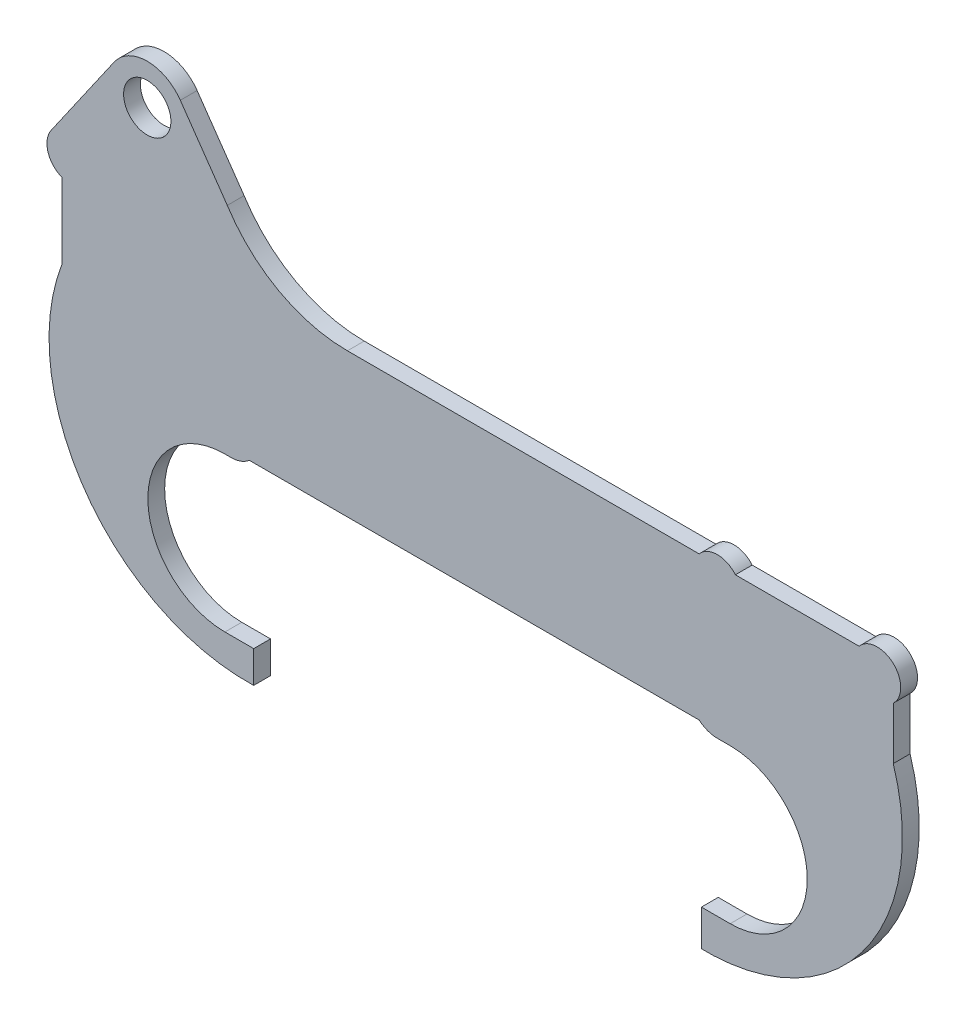
ISO-10303-21;
HEADER;
FILE_DESCRIPTION(('STEP AP214'),'2;1');
FILE_NAME('part.step','',(''),(''),'','','');
FILE_SCHEMA(('AUTOMOTIVE_DESIGN { 1 0 10303 214 1 1 1 1 }'));
ENDSEC;
DATA;
#1=APPLICATION_CONTEXT('core data for automotive mechanical design processes');
#2=APPLICATION_PROTOCOL_DEFINITION('international standard','automotive_design',2000,#1);
#3=PRODUCT_CONTEXT('',#1,'mechanical');
#4=PRODUCT('Part','Part','',(#3));
#5=PRODUCT_RELATED_PRODUCT_CATEGORY('part','',(#4));
#6=PRODUCT_DEFINITION_FORMATION('','',#4);
#7=PRODUCT_DEFINITION_CONTEXT('part definition',#1,'design');
#8=PRODUCT_DEFINITION('design','',#6,#7);
#9=PRODUCT_DEFINITION_SHAPE('','',#8);
#10=(LENGTH_UNIT() NAMED_UNIT(*) SI_UNIT(.MILLI.,.METRE.));
#11=(NAMED_UNIT(*) PLANE_ANGLE_UNIT() SI_UNIT($,.RADIAN.));
#12=(NAMED_UNIT(*) SI_UNIT($,.STERADIAN.) SOLID_ANGLE_UNIT());
#13=UNCERTAINTY_MEASURE_WITH_UNIT(LENGTH_MEASURE(1.E-05),#10,'distance_accuracy_value','');
#14=(GEOMETRIC_REPRESENTATION_CONTEXT(3) GLOBAL_UNCERTAINTY_ASSIGNED_CONTEXT((#13)) GLOBAL_UNIT_ASSIGNED_CONTEXT((#10,
#11,#12)) REPRESENTATION_CONTEXT('',''));
#15=CARTESIAN_POINT('',(0.,0.,0.));
#16=DIRECTION('',(0.,0.,1.));
#17=DIRECTION('',(1.,0.,0.));
#18=AXIS2_PLACEMENT_3D('',#15,#16,#17);
#19=CARTESIAN_POINT('',(0.,0.,6.6802));
#20=DIRECTION('',(0.,1.,0.));
#21=DIRECTION('',(0.,0.,1.));
#22=AXIS2_PLACEMENT_3D('',#19,#20,#21);
#23=PLANE('',#22);
#24=DIRECTION('',(1.,0.,0.));
#25=VECTOR('',#24,1.);
#26=CARTESIAN_POINT('',(0.,0.,0.));
#27=LINE('',#26,#25);
#28=CARTESIAN_POINT('',(74.4752342171825,0.,0.));
#29=VERTEX_POINT('',#28);
#30=CARTESIAN_POINT('',(253.108565782818,0.,0.));
#31=VERTEX_POINT('',#30);
#32=EDGE_CURVE('E240',#29,#31,#27,.T.);
#33=ORIENTED_EDGE('',*,*,#32,.T.);
#34=DIRECTION('',(0.,0.,-1.));
#35=VECTOR('',#34,1.);
#36=CARTESIAN_POINT('',(253.108565782818,0.,6.6802));
#37=LINE('',#36,#35);
#38=CARTESIAN_POINT('',(253.108565782818,0.,6.6802));
#39=VERTEX_POINT('',#38);
#40=EDGE_CURVE('E11',#39,#31,#37,.T.);
#41=ORIENTED_EDGE('',*,*,#40,.F.);
#42=DIRECTION('',(1.,0.,0.));
#43=VECTOR('',#42,1.);
#44=CARTESIAN_POINT('',(0.,0.,6.6802));
#45=LINE('',#44,#43);
#46=CARTESIAN_POINT('',(74.4752342171825,0.,6.6802));
#47=VERTEX_POINT('',#46);
#48=EDGE_CURVE('E373',#47,#39,#45,.T.);
#49=ORIENTED_EDGE('',*,*,#48,.F.);
#50=DIRECTION('',(0.,0.,-1.));
#51=VECTOR('',#50,1.);
#52=CARTESIAN_POINT('',(74.4752342171825,0.,6.6802));
#53=LINE('',#52,#51);
#54=EDGE_CURVE('E236',#47,#29,#53,.T.);
#55=ORIENTED_EDGE('',*,*,#54,.T.);
#56=EDGE_LOOP('',(#33,#41,#49,#55));
#57=FACE_BOUND('',#56,.T.);
#58=ADVANCED_FACE('F36',(#57),#23,.F.);
#59=CARTESIAN_POINT('',(260.3119,8.39428849726891,6.6802));
#60=DIRECTION('',(0.,0.,-1.));
#61=DIRECTION('',(-1.,0.,0.));
#62=AXIS2_PLACEMENT_3D('',#59,#60,#61);
#63=CYLINDRICAL_SURFACE('',#62,11.0612884972689);
#64=CARTESIAN_POINT('',(260.3119,8.39428849726891,0.));
#65=DIRECTION('',(0.,0.,1.));
#66=DIRECTION('',(1.,0.,0.));
#67=AXIS2_PLACEMENT_3D('',#64,#65,#66);
#68=CIRCLE('',#67,11.0612884972689);
#69=CARTESIAN_POINT('',(260.3119,-2.66699999999997,0.));
#70=VERTEX_POINT('',#69);
#71=EDGE_CURVE('E243',#31,#70,#68,.T.);
#72=ORIENTED_EDGE('',*,*,#71,.T.);
#73=DIRECTION('',(0.,0.,-1.));
#74=VECTOR('',#73,1.);
#75=CARTESIAN_POINT('',(260.3119,-2.66699999999997,6.6802));
#76=LINE('',#75,#74);
#77=CARTESIAN_POINT('',(260.3119,-2.66699999999997,6.6802));
#78=VERTEX_POINT('',#77);
#79=EDGE_CURVE('E45',#78,#70,#76,.T.);
#80=ORIENTED_EDGE('',*,*,#79,.F.);
#81=CARTESIAN_POINT('',(260.3119,8.39428849726891,6.6802));
#82=DIRECTION('',(0.,0.,1.));
#83=DIRECTION('',(1.,0.,0.));
#84=AXIS2_PLACEMENT_3D('',#81,#82,#83);
#85=CIRCLE('',#84,11.0612884972689);
#86=EDGE_CURVE('E146',#39,#78,#85,.T.);
#87=ORIENTED_EDGE('',*,*,#86,.F.);
#88=ORIENTED_EDGE('',*,*,#40,.T.);
#89=EDGE_LOOP('',(#72,#80,#87,#88));
#90=FACE_BOUND('',#89,.T.);
#91=ADVANCED_FACE('F356',(#90),#63,.T.);
#92=CARTESIAN_POINT('',(0.,-2.66699999999776,6.6802));
#93=DIRECTION('',(0.,-1.,0.));
#94=DIRECTION('',(1.,0.,0.));
#95=AXIS2_PLACEMENT_3D('',#92,#93,#94);
#96=PLANE('',#95);
#97=DIRECTION('',(-1.,0.,0.));
#98=VECTOR('',#97,1.);
#99=CARTESIAN_POINT('',(0.,-2.66699999999776,0.));
#100=LINE('',#99,#98);
#101=CARTESIAN_POINT('',(265.43,-2.66700000000001,0.));
#102=VERTEX_POINT('',#101);
#103=EDGE_CURVE('E246',#102,#70,#100,.T.);
#104=ORIENTED_EDGE('',*,*,#103,.F.);
#105=DIRECTION('',(0.,0.,-1.));
#106=VECTOR('',#105,1.);
#107=CARTESIAN_POINT('',(265.43,-2.66700000000001,6.6802));
#108=LINE('',#107,#106);
#109=CARTESIAN_POINT('',(265.43,-2.66700000000001,6.6802));
#110=VERTEX_POINT('',#109);
#111=EDGE_CURVE('E349',#110,#102,#108,.T.);
#112=ORIENTED_EDGE('',*,*,#111,.F.);
#113=DIRECTION('',(-1.,0.,0.));
#114=VECTOR('',#113,1.);
#115=CARTESIAN_POINT('',(0.,-2.66699999999776,6.6802));
#116=LINE('',#115,#114);
#117=EDGE_CURVE('E355',#110,#78,#116,.T.);
#118=ORIENTED_EDGE('',*,*,#117,.T.);
#119=ORIENTED_EDGE('',*,*,#79,.T.);
#120=EDGE_LOOP('',(#104,#112,#118,#119));
#121=FACE_BOUND('',#120,.T.);
#122=ADVANCED_FACE('F353',(#121),#96,.T.);
#123=CARTESIAN_POINT('',(265.43,-33.274,6.6802));
#124=DIRECTION('',(0.,0.,-1.));
#125=DIRECTION('',(-1.,0.,0.));
#126=AXIS2_PLACEMENT_3D('',#123,#124,#125);
#127=CYLINDRICAL_SURFACE('',#126,30.607);
#128=CARTESIAN_POINT('',(265.43,-33.274,0.));
#129=DIRECTION('',(0.,0.,1.));
#130=DIRECTION('',(1.,0.,0.));
#131=AXIS2_PLACEMENT_3D('',#128,#129,#130);
#132=CIRCLE('',#131,30.607);
#133=CARTESIAN_POINT('',(265.43,-63.881,0.));
#134=VERTEX_POINT('',#133);
#135=EDGE_CURVE('E249',#134,#102,#132,.T.);
#136=ORIENTED_EDGE('',*,*,#135,.F.);
#137=DIRECTION('',(0.,0.,-1.));
#138=VECTOR('',#137,1.);
#139=CARTESIAN_POINT('',(265.43,-63.881,6.6802));
#140=LINE('',#139,#138);
#141=CARTESIAN_POINT('',(265.43,-63.881,6.6802));
#142=VERTEX_POINT('',#141);
#143=EDGE_CURVE('E347',#142,#134,#140,.T.);
#144=ORIENTED_EDGE('',*,*,#143,.F.);
#145=CARTESIAN_POINT('',(265.43,-33.274,6.6802));
#146=DIRECTION('',(0.,0.,1.));
#147=DIRECTION('',(1.,0.,0.));
#148=AXIS2_PLACEMENT_3D('',#145,#146,#147);
#149=CIRCLE('',#148,30.607);
#150=EDGE_CURVE('E369',#142,#110,#149,.T.);
#151=ORIENTED_EDGE('',*,*,#150,.T.);
#152=ORIENTED_EDGE('',*,*,#111,.T.);
#153=EDGE_LOOP('',(#136,#144,#151,#152));
#154=FACE_BOUND('',#153,.T.);
#155=ADVANCED_FACE('F365',(#154),#127,.F.);
#156=CARTESIAN_POINT('',(0.,-63.8809999999997,6.6802));
#157=DIRECTION('',(0.,-1.,0.));
#158=DIRECTION('',(1.,0.,0.));
#159=AXIS2_PLACEMENT_3D('',#156,#157,#158);
#160=PLANE('',#159);
#161=DIRECTION('',(-1.,0.,0.));
#162=VECTOR('',#161,1.);
#163=CARTESIAN_POINT('',(0.,-63.8809999999997,0.));
#164=LINE('',#163,#162);
#165=CARTESIAN_POINT('',(254.,-63.881,0.));
#166=VERTEX_POINT('',#165);
#167=EDGE_CURVE('E252',#134,#166,#164,.T.);
#168=ORIENTED_EDGE('',*,*,#167,.T.);
#169=DIRECTION('',(0.,0.,-1.));
#170=VECTOR('',#169,1.);
#171=CARTESIAN_POINT('',(254.,-63.881,6.6802));
#172=LINE('',#171,#170);
#173=CARTESIAN_POINT('',(254.,-63.881,6.6802));
#174=VERTEX_POINT('',#173);
#175=EDGE_CURVE('E344',#174,#166,#172,.T.);
#176=ORIENTED_EDGE('',*,*,#175,.F.);
#177=DIRECTION('',(-1.,0.,0.));
#178=VECTOR('',#177,1.);
#179=CARTESIAN_POINT('',(0.,-63.8809999999997,6.6802));
#180=LINE('',#179,#178);
#181=EDGE_CURVE('E371',#142,#174,#180,.T.);
#182=ORIENTED_EDGE('',*,*,#181,.F.);
#183=ORIENTED_EDGE('',*,*,#143,.T.);
#184=EDGE_LOOP('',(#168,#176,#182,#183));
#185=FACE_BOUND('',#184,.T.);
#186=ADVANCED_FACE('F447',(#185),#160,.F.);
#187=CARTESIAN_POINT('',(254.,0.,6.6802));
#188=DIRECTION('',(1.,0.,0.));
#189=DIRECTION('',(0.,0.,-1.));
#190=AXIS2_PLACEMENT_3D('',#187,#188,#189);
#191=PLANE('',#190);
#192=DIRECTION('',(0.,-1.,0.));
#193=VECTOR('',#192,1.);
#194=CARTESIAN_POINT('',(254.,0.,0.));
#195=LINE('',#194,#193);
#196=CARTESIAN_POINT('',(254.,-78.1924621020167,0.));
#197=VERTEX_POINT('',#196);
#198=EDGE_CURVE('E254',#166,#197,#195,.T.);
#199=ORIENTED_EDGE('',*,*,#198,.T.);
#200=DIRECTION('',(0.,0.,-1.));
#201=VECTOR('',#200,1.);
#202=CARTESIAN_POINT('',(254.,-78.1924621020167,6.6802));
#203=LINE('',#202,#201);
#204=CARTESIAN_POINT('',(254.,-78.1924621020167,6.6802));
#205=VERTEX_POINT('',#204);
#206=EDGE_CURVE('E342',#205,#197,#203,.T.);
#207=ORIENTED_EDGE('',*,*,#206,.F.);
#208=DIRECTION('',(0.,-1.,0.));
#209=VECTOR('',#208,1.);
#210=CARTESIAN_POINT('',(254.,0.,6.6802));
#211=LINE('',#210,#209);
#212=EDGE_CURVE('E378',#174,#205,#211,.T.);
#213=ORIENTED_EDGE('',*,*,#212,.F.);
#214=ORIENTED_EDGE('',*,*,#175,.T.);
#215=EDGE_LOOP('',(#199,#207,#213,#214));
#216=FACE_BOUND('',#215,.T.);
#217=ADVANCED_FACE('F450',(#216),#191,.F.);
#218=CARTESIAN_POINT('',(4.51694506166777E-13,-78.1924621020182,6.6802));
#219=DIRECTION('',(0.,-1.,0.));
#220=DIRECTION('',(1.,0.,0.));
#221=AXIS2_PLACEMENT_3D('',#218,#219,#220);
#222=PLANE('',#221);
#223=DIRECTION('',(-1.,0.,0.));
#224=VECTOR('',#223,1.);
#225=CARTESIAN_POINT('',(4.51694506166777E-13,-78.1924621020182,0.));
#226=LINE('',#225,#224);
#227=CARTESIAN_POINT('',(258.804744721964,-78.1924621020167,0.));
#228=VERTEX_POINT('',#227);
#229=EDGE_CURVE('E257',#228,#197,#226,.T.);
#230=ORIENTED_EDGE('',*,*,#229,.F.);
#231=DIRECTION('',(0.,0.,-1.));
#232=VECTOR('',#231,1.);
#233=CARTESIAN_POINT('',(258.804744721964,-78.1924621020167,6.6802));
#234=LINE('',#233,#232);
#235=CARTESIAN_POINT('',(258.804744721964,-78.1924621020167,6.6802));
#236=VERTEX_POINT('',#235);
#237=EDGE_CURVE('E340',#236,#228,#234,.T.);
#238=ORIENTED_EDGE('',*,*,#237,.F.);
#239=DIRECTION('',(-1.,0.,0.));
#240=VECTOR('',#239,1.);
#241=CARTESIAN_POINT('',(4.51694506166777E-13,-78.1924621020182,6.6802));
#242=LINE('',#241,#240);
#243=EDGE_CURVE('E380',#236,#205,#242,.T.);
#244=ORIENTED_EDGE('',*,*,#243,.T.);
#245=ORIENTED_EDGE('',*,*,#206,.T.);
#246=EDGE_LOOP('',(#230,#238,#244,#245));
#247=FACE_BOUND('',#246,.T.);
#248=ADVANCED_FACE('F454',(#247),#222,.T.);
#249=CARTESIAN_POINT('',(255.575891342925,0.,6.6802));
#250=DIRECTION('',(0.,0.,-1.));
#251=DIRECTION('',(-1.,0.,0.));
#252=AXIS2_PLACEMENT_3D('',#249,#250,#251);
#253=CYLINDRICAL_SURFACE('',#252,78.2590993030117);
#254=CARTESIAN_POINT('',(255.575891342925,0.,0.));
#255=DIRECTION('',(0.,0.,1.));
#256=DIRECTION('',(1.,0.,0.));
#257=AXIS2_PLACEMENT_3D('',#254,#255,#256);
#258=CIRCLE('',#257,78.2590993030117);
#259=CARTESIAN_POINT('',(330.2,23.5739057191571,0.));
#260=VERTEX_POINT('',#259);
#261=EDGE_CURVE('E260',#228,#260,#258,.T.);
#262=ORIENTED_EDGE('',*,*,#261,.T.);
#263=DIRECTION('',(0.,0.,-1.));
#264=VECTOR('',#263,1.);
#265=CARTESIAN_POINT('',(330.2,23.5739057191571,6.6802));
#266=LINE('',#265,#264);
#267=CARTESIAN_POINT('',(330.2,23.5739057191571,6.6802));
#268=VERTEX_POINT('',#267);
#269=EDGE_CURVE('E337',#268,#260,#266,.T.);
#270=ORIENTED_EDGE('',*,*,#269,.F.);
#271=CARTESIAN_POINT('',(255.575891342925,0.,6.6802));
#272=DIRECTION('',(0.,0.,1.));
#273=DIRECTION('',(1.,0.,0.));
#274=AXIS2_PLACEMENT_3D('',#271,#272,#273);
#275=CIRCLE('',#274,78.2590993030117);
#276=EDGE_CURVE('E383',#236,#268,#275,.T.);
#277=ORIENTED_EDGE('',*,*,#276,.F.);
#278=ORIENTED_EDGE('',*,*,#237,.T.);
#279=EDGE_LOOP('',(#262,#270,#277,#278));
#280=FACE_BOUND('',#279,.T.);
#281=ADVANCED_FACE('F458',(#280),#253,.T.);
#282=CARTESIAN_POINT('',(330.2,1.7649972717152E-12,6.6802));
#283=DIRECTION('',(-1.,0.,0.));
#284=DIRECTION('',(0.,-1.,0.));
#285=AXIS2_PLACEMENT_3D('',#282,#283,#284);
#286=PLANE('',#285);
#287=DIRECTION('',(0.,1.,0.));
#288=VECTOR('',#287,1.);
#289=CARTESIAN_POINT('',(330.2,1.7649972717152E-12,0.));
#290=LINE('',#289,#288);
#291=CARTESIAN_POINT('',(330.2,44.3442291981829,0.));
#292=VERTEX_POINT('',#291);
#293=EDGE_CURVE('E262',#260,#292,#290,.T.);
#294=ORIENTED_EDGE('',*,*,#293,.T.);
#295=DIRECTION('',(0.,0.,-1.));
#296=VECTOR('',#295,1.);
#297=CARTESIAN_POINT('',(330.2,44.3442291981829,6.6802));
#298=LINE('',#297,#296);
#299=CARTESIAN_POINT('',(330.2,44.3442291981829,6.6802));
#300=VERTEX_POINT('',#299);
#301=EDGE_CURVE('E334',#300,#292,#298,.T.);
#302=ORIENTED_EDGE('',*,*,#301,.F.);
#303=DIRECTION('',(0.,1.,0.));
#304=VECTOR('',#303,1.);
#305=CARTESIAN_POINT('',(330.2,1.7649972717152E-12,6.6802));
#306=LINE('',#305,#304);
#307=EDGE_CURVE('E385',#268,#300,#306,.T.);
#308=ORIENTED_EDGE('',*,*,#307,.F.);
#309=ORIENTED_EDGE('',*,*,#269,.T.);
#310=EDGE_LOOP('',(#294,#302,#308,#309));
#311=FACE_BOUND('',#310,.T.);
#312=ADVANCED_FACE('F462',(#311),#286,.F.);
#313=CARTESIAN_POINT('',(323.8119,51.1678884972689,6.6802));
#314=DIRECTION('',(0.,0.,-1.));
#315=DIRECTION('',(-1.,0.,0.));
#316=AXIS2_PLACEMENT_3D('',#313,#314,#315);
#317=CYLINDRICAL_SURFACE('',#316,9.3472);
#318=CARTESIAN_POINT('',(323.8119,51.1678884972689,0.));
#319=DIRECTION('',(0.,0.,1.));
#320=DIRECTION('',(1.,0.,0.));
#321=AXIS2_PLACEMENT_3D('',#318,#319,#320);
#322=CIRCLE('',#321,9.3472);
#323=CARTESIAN_POINT('',(316.629665681288,57.15,0.));
#324=VERTEX_POINT('',#323);
#325=EDGE_CURVE('E264',#292,#324,#322,.T.);
#326=ORIENTED_EDGE('',*,*,#325,.T.);
#327=DIRECTION('',(0.,0.,-1.));
#328=VECTOR('',#327,1.);
#329=CARTESIAN_POINT('',(316.629665681288,57.15,6.6802));
#330=LINE('',#329,#328);
#331=CARTESIAN_POINT('',(316.629665681288,57.15,6.6802));
#332=VERTEX_POINT('',#331);
#333=EDGE_CURVE('E332',#332,#324,#330,.T.);
#334=ORIENTED_EDGE('',*,*,#333,.F.);
#335=CARTESIAN_POINT('',(323.8119,51.1678884972689,6.6802));
#336=DIRECTION('',(0.,0.,1.));
#337=DIRECTION('',(1.,0.,0.));
#338=AXIS2_PLACEMENT_3D('',#335,#336,#337);
#339=CIRCLE('',#338,9.3472);
#340=EDGE_CURVE('E387',#300,#332,#339,.T.);
#341=ORIENTED_EDGE('',*,*,#340,.F.);
#342=ORIENTED_EDGE('',*,*,#301,.T.);
#343=EDGE_LOOP('',(#326,#334,#341,#342));
#344=FACE_BOUND('',#343,.T.);
#345=ADVANCED_FACE('F466',(#344),#317,.T.);
#346=CARTESIAN_POINT('',(0.,57.15,6.6802));
#347=DIRECTION('',(0.,1.,0.));
#348=DIRECTION('',(0.,0.,1.));
#349=AXIS2_PLACEMENT_3D('',#346,#347,#348);
#350=PLANE('',#349);
#351=DIRECTION('',(1.,0.,0.));
#352=VECTOR('',#351,1.);
#353=CARTESIAN_POINT('',(0.,57.15,0.));
#354=LINE('',#353,#352);
#355=CARTESIAN_POINT('',(267.494134318713,57.15,0.));
#356=VERTEX_POINT('',#355);
#357=EDGE_CURVE('E267',#356,#324,#354,.T.);
#358=ORIENTED_EDGE('',*,*,#357,.F.);
#359=DIRECTION('',(0.,0.,-1.));
#360=VECTOR('',#359,1.);
#361=CARTESIAN_POINT('',(267.494134318713,57.15,6.6802));
#362=LINE('',#361,#360);
#363=CARTESIAN_POINT('',(267.494134318713,57.15,6.6802));
#364=VERTEX_POINT('',#363);
#365=EDGE_CURVE('E330',#364,#356,#362,.T.);
#366=ORIENTED_EDGE('',*,*,#365,.F.);
#367=DIRECTION('',(1.,0.,0.));
#368=VECTOR('',#367,1.);
#369=CARTESIAN_POINT('',(0.,57.15,6.6802));
#370=LINE('',#369,#368);
#371=EDGE_CURVE('E389',#364,#332,#370,.T.);
#372=ORIENTED_EDGE('',*,*,#371,.T.);
#373=ORIENTED_EDGE('',*,*,#333,.T.);
#374=EDGE_LOOP('',(#358,#366,#372,#373));
#375=FACE_BOUND('',#374,.T.);
#376=ADVANCED_FACE('F470',(#375),#350,.T.);
#377=CARTESIAN_POINT('',(260.3119,51.1678884972689,6.6802));
#378=DIRECTION('',(0.,0.,-1.));
#379=DIRECTION('',(-1.,0.,0.));
#380=AXIS2_PLACEMENT_3D('',#377,#378,#379);
#381=CYLINDRICAL_SURFACE('',#380,9.34720000000001);
#382=CARTESIAN_POINT('',(260.3119,51.1678884972689,0.));
#383=DIRECTION('',(0.,0.,1.));
#384=DIRECTION('',(1.,0.,0.));
#385=AXIS2_PLACEMENT_3D('',#382,#383,#384);
#386=CIRCLE('',#385,9.34720000000001);
#387=CARTESIAN_POINT('',(253.129665681288,57.15,0.));
#388=VERTEX_POINT('',#387);
#389=EDGE_CURVE('E270',#356,#388,#386,.T.);
#390=ORIENTED_EDGE('',*,*,#389,.T.);
#391=DIRECTION('',(0.,0.,-1.));
#392=VECTOR('',#391,1.);
#393=CARTESIAN_POINT('',(253.129665681288,57.15,6.6802));
#394=LINE('',#393,#392);
#395=CARTESIAN_POINT('',(253.129665681288,57.15,6.6802));
#396=VERTEX_POINT('',#395);
#397=EDGE_CURVE('E328',#396,#388,#394,.T.);
#398=ORIENTED_EDGE('',*,*,#397,.F.);
#399=CARTESIAN_POINT('',(260.3119,51.1678884972689,6.6802));
#400=DIRECTION('',(0.,0.,1.));
#401=DIRECTION('',(1.,0.,0.));
#402=AXIS2_PLACEMENT_3D('',#399,#400,#401);
#403=CIRCLE('',#402,9.34720000000001);
#404=EDGE_CURVE('E392',#364,#396,#403,.T.);
#405=ORIENTED_EDGE('',*,*,#404,.F.);
#406=ORIENTED_EDGE('',*,*,#365,.T.);
#407=EDGE_LOOP('',(#390,#398,#405,#406));
#408=FACE_BOUND('',#407,.T.);
#409=ADVANCED_FACE('F474',(#408),#381,.T.);
#410=CARTESIAN_POINT('',(0.,57.15,6.6802));
#411=DIRECTION('',(0.,1.,0.));
#412=DIRECTION('',(0.,0.,1.));
#413=AXIS2_PLACEMENT_3D('',#410,#411,#412);
#414=PLANE('',#413);
#415=DIRECTION('',(1.,0.,0.));
#416=VECTOR('',#415,1.);
#417=CARTESIAN_POINT('',(0.,57.15,0.));
#418=LINE('',#417,#416);
#419=CARTESIAN_POINT('',(113.415260688281,57.15,0.));
#420=VERTEX_POINT('',#419);
#421=EDGE_CURVE('E273',#420,#388,#418,.T.);
#422=ORIENTED_EDGE('',*,*,#421,.F.);
#423=DIRECTION('',(0.,0.,-1.));
#424=VECTOR('',#423,1.);
#425=CARTESIAN_POINT('',(113.415260688281,57.15,6.6802));
#426=LINE('',#425,#424);
#427=CARTESIAN_POINT('',(113.415260688281,57.15,6.6802));
#428=VERTEX_POINT('',#427);
#429=EDGE_CURVE('E326',#428,#420,#426,.T.);
#430=ORIENTED_EDGE('',*,*,#429,.F.);
#431=DIRECTION('',(1.,0.,0.));
#432=VECTOR('',#431,1.);
#433=CARTESIAN_POINT('',(0.,57.15,6.6802));
#434=LINE('',#433,#432);
#435=EDGE_CURVE('E394',#428,#396,#434,.T.);
#436=ORIENTED_EDGE('',*,*,#435,.T.);
#437=ORIENTED_EDGE('',*,*,#397,.T.);
#438=EDGE_LOOP('',(#422,#430,#436,#437));
#439=FACE_BOUND('',#438,.T.);
#440=ADVANCED_FACE('F478',(#439),#414,.T.);
#441=CARTESIAN_POINT('',(113.415260688281,113.711052983826,6.6802));
#442=DIRECTION('',(0.,0.,-1.));
#443=DIRECTION('',(-1.,0.,0.));
#444=AXIS2_PLACEMENT_3D('',#441,#442,#443);
#445=CYLINDRICAL_SURFACE('',#444,56.561052983826);
#446=CARTESIAN_POINT('',(113.415260688281,113.711052983826,0.));
#447=DIRECTION('',(0.,0.,1.));
#448=DIRECTION('',(1.,0.,0.));
#449=AXIS2_PLACEMENT_3D('',#446,#447,#448);
#450=CIRCLE('',#449,56.561052983826);
#451=CARTESIAN_POINT('',(65.7097247748721,83.3246323678077,0.));
#452=VERTEX_POINT('',#451);
#453=EDGE_CURVE('E276',#452,#420,#450,.T.);
#454=ORIENTED_EDGE('',*,*,#453,.F.);
#455=DIRECTION('',(0.,0.,-1.));
#456=VECTOR('',#455,1.);
#457=CARTESIAN_POINT('',(65.7097247748721,83.3246323678077,6.6802));
#458=LINE('',#457,#456);
#459=CARTESIAN_POINT('',(65.7097247748721,83.3246323678077,6.6802));
#460=VERTEX_POINT('',#459);
#461=EDGE_CURVE('E324',#460,#452,#458,.T.);
#462=ORIENTED_EDGE('',*,*,#461,.F.);
#463=CARTESIAN_POINT('',(113.415260688281,113.711052983826,6.6802));
#464=DIRECTION('',(0.,0.,1.));
#465=DIRECTION('',(1.,0.,0.));
#466=AXIS2_PLACEMENT_3D('',#463,#464,#465);
#467=CIRCLE('',#466,56.561052983826);
#468=EDGE_CURVE('E397',#460,#428,#467,.T.);
#469=ORIENTED_EDGE('',*,*,#468,.T.);
#470=ORIENTED_EDGE('',*,*,#429,.T.);
#471=EDGE_LOOP('',(#454,#462,#469,#470));
#472=FACE_BOUND('',#471,.T.);
#473=ADVANCED_FACE('F482',(#472),#445,.F.);
#474=CARTESIAN_POINT('',(83.3451153624948,57.9695209357769,6.6802));
#475=DIRECTION('',(-0.82094994249364,-0.571000168055744,0.));
#476=DIRECTION('',(0.571000168055744,-0.820949942493641,0.));
#477=AXIS2_PLACEMENT_3D('',#474,#475,#476);
#478=PLANE('',#477);
#479=DIRECTION('',(-0.571000168055744,0.820949942493641,0.));
#480=VECTOR('',#479,1.);
#481=CARTESIAN_POINT('',(83.3451153624948,57.9695209357769,0.));
#482=LINE('',#481,#480);
#483=CARTESIAN_POINT('',(47.0585033672193,110.140244689228,0.));
#484=VERTEX_POINT('',#483);
#485=EDGE_CURVE('E279',#452,#484,#482,.T.);
#486=ORIENTED_EDGE('',*,*,#485,.T.);
#487=DIRECTION('',(0.,0.,-1.));
#488=VECTOR('',#487,1.);
#489=CARTESIAN_POINT('',(47.0585033672193,110.140244689228,6.6802));
#490=LINE('',#489,#488);
#491=CARTESIAN_POINT('',(47.0585033672193,110.140244689228,6.6802));
#492=VERTEX_POINT('',#491);
#493=EDGE_CURVE('E321',#492,#484,#490,.T.);
#494=ORIENTED_EDGE('',*,*,#493,.F.);
#495=DIRECTION('',(-0.571000168055744,0.820949942493641,0.));
#496=VECTOR('',#495,1.);
#497=CARTESIAN_POINT('',(83.3451153624948,57.9695209357769,6.6802));
#498=LINE('',#497,#496);
#499=EDGE_CURVE('E400',#460,#492,#498,.T.);
#500=ORIENTED_EDGE('',*,*,#499,.F.);
#501=ORIENTED_EDGE('',*,*,#461,.T.);
#502=EDGE_LOOP('',(#486,#494,#500,#501));
#503=FACE_BOUND('',#502,.T.);
#504=ADVANCED_FACE('F486',(#503),#478,.F.);
#505=CARTESIAN_POINT('',(33.9216623874361,101.0031,6.6802));
#506=DIRECTION('',(0.,0.,-1.));
#507=DIRECTION('',(-1.,0.,0.));
#508=AXIS2_PLACEMENT_3D('',#505,#506,#507);
#509=CYLINDRICAL_SURFACE('',#508,16.002);
#510=CARTESIAN_POINT('',(33.9216623874361,101.0031,0.));
#511=DIRECTION('',(0.,0.,1.));
#512=DIRECTION('',(1.,0.,0.));
#513=AXIS2_PLACEMENT_3D('',#510,#511,#512);
#514=CIRCLE('',#513,16.002);
#515=CARTESIAN_POINT('',(20.7848214076528,110.140244689228,0.));
#516=VERTEX_POINT('',#515);
#517=EDGE_CURVE('E281',#484,#516,#514,.T.);
#518=ORIENTED_EDGE('',*,*,#517,.T.);
#519=DIRECTION('',(0.,0.,-1.));
#520=VECTOR('',#519,1.);
#521=CARTESIAN_POINT('',(20.7848214076528,110.140244689228,6.6802));
#522=LINE('',#521,#520);
#523=CARTESIAN_POINT('',(20.7848214076528,110.140244689228,6.6802));
#524=VERTEX_POINT('',#523);
#525=EDGE_CURVE('E319',#524,#516,#522,.T.);
#526=ORIENTED_EDGE('',*,*,#525,.F.);
#527=CARTESIAN_POINT('',(33.9216623874361,101.0031,6.6802));
#528=DIRECTION('',(0.,0.,1.));
#529=DIRECTION('',(1.,0.,0.));
#530=AXIS2_PLACEMENT_3D('',#527,#528,#529);
#531=CIRCLE('',#530,16.002);
#532=EDGE_CURVE('E402',#492,#524,#531,.T.);
#533=ORIENTED_EDGE('',*,*,#532,.F.);
#534=ORIENTED_EDGE('',*,*,#493,.T.);
#535=EDGE_LOOP('',(#518,#526,#533,#534));
#536=FACE_BOUND('',#535,.T.);
#537=ADVANCED_FACE('F490',(#536),#509,.T.);
#538=CARTESIAN_POINT('',(-37.6215090610164,26.1671106658461,6.6802));
#539=DIRECTION('',(-0.820949942493641,0.571000168055744,0.));
#540=DIRECTION('',(-0.571000168055744,-0.820949942493641,0.));
#541=AXIS2_PLACEMENT_3D('',#538,#539,#540);
#542=PLANE('',#541);
#543=DIRECTION('',(0.571000168055744,0.820949942493641,0.));
#544=VECTOR('',#543,1.);
#545=CARTESIAN_POINT('',(-37.6215090610164,26.1671106658461,0.));
#546=LINE('',#545,#544);
#547=CARTESIAN_POINT('',(-4.2359920945924,74.166813235164,0.));
#548=VERTEX_POINT('',#547);
#549=EDGE_CURVE('E284',#548,#516,#546,.T.);
#550=ORIENTED_EDGE('',*,*,#549,.F.);
#551=DIRECTION('',(0.,0.,-1.));
#552=VECTOR('',#551,1.);
#553=CARTESIAN_POINT('',(-4.2359920945924,74.166813235164,6.6802));
#554=LINE('',#553,#552);
#555=CARTESIAN_POINT('',(-4.2359920945924,74.166813235164,6.6802));
#556=VERTEX_POINT('',#555);
#557=EDGE_CURVE('E317',#556,#548,#554,.T.);
#558=ORIENTED_EDGE('',*,*,#557,.F.);
#559=DIRECTION('',(0.571000168055744,0.820949942493641,0.));
#560=VECTOR('',#559,1.);
#561=CARTESIAN_POINT('',(-37.6215090610164,26.1671106658461,6.6802));
#562=LINE('',#561,#560);
#563=EDGE_CURVE('E404',#556,#524,#562,.T.);
#564=ORIENTED_EDGE('',*,*,#563,.T.);
#565=ORIENTED_EDGE('',*,*,#525,.T.);
#566=EDGE_LOOP('',(#550,#558,#564,#565));
#567=FACE_BOUND('',#566,.T.);
#568=ADVANCED_FACE('F494',(#567),#542,.T.);
#569=CARTESIAN_POINT('',(3.43759120788416,68.8295604643134,6.6802));
#570=DIRECTION('',(0.,0.,-1.));
#571=DIRECTION('',(-1.,0.,0.));
#572=AXIS2_PLACEMENT_3D('',#569,#570,#571);
#573=CYLINDRICAL_SURFACE('',#572,9.3472);
#574=CARTESIAN_POINT('',(3.43759120788416,68.8295604643134,0.));
#575=DIRECTION('',(0.,0.,1.));
#576=DIRECTION('',(1.,0.,0.));
#577=AXIS2_PLACEMENT_3D('',#574,#575,#576);
#578=CIRCLE('',#577,9.3472);
#579=CARTESIAN_POINT('',(-2.22044604925031E-13,60.1374310055745,0.));
#580=VERTEX_POINT('',#579);
#581=EDGE_CURVE('E287',#548,#580,#578,.T.);
#582=ORIENTED_EDGE('',*,*,#581,.T.);
#583=DIRECTION('',(0.,0.,-1.));
#584=VECTOR('',#583,1.);
#585=CARTESIAN_POINT('',(-2.22044604925031E-13,60.1374310055745,6.6802));
#586=LINE('',#585,#584);
#587=CARTESIAN_POINT('',(-2.22044604925031E-13,60.1374310055745,6.6802));
#588=VERTEX_POINT('',#587);
#589=EDGE_CURVE('E315',#588,#580,#586,.T.);
#590=ORIENTED_EDGE('',*,*,#589,.F.);
#591=CARTESIAN_POINT('',(3.43759120788416,68.8295604643134,6.6802));
#592=DIRECTION('',(0.,0.,1.));
#593=DIRECTION('',(1.,0.,0.));
#594=AXIS2_PLACEMENT_3D('',#591,#592,#593);
#595=CIRCLE('',#594,9.3472);
#596=EDGE_CURVE('E407',#556,#588,#595,.T.);
#597=ORIENTED_EDGE('',*,*,#596,.F.);
#598=ORIENTED_EDGE('',*,*,#557,.T.);
#599=EDGE_LOOP('',(#582,#590,#597,#598));
#600=FACE_BOUND('',#599,.T.);
#601=ADVANCED_FACE('F498',(#600),#573,.T.);
#602=CARTESIAN_POINT('',(0.,0.,6.6802));
#603=DIRECTION('',(-1.,0.,0.));
#604=DIRECTION('',(0.,-1.,0.));
#605=AXIS2_PLACEMENT_3D('',#602,#603,#604);
#606=PLANE('',#605);
#607=DIRECTION('',(0.,1.,0.));
#608=VECTOR('',#607,1.);
#609=CARTESIAN_POINT('',(0.,0.,0.));
#610=LINE('',#609,#608);
#611=CARTESIAN_POINT('',(-1.11022302462516E-13,30.0884320351461,0.));
#612=VERTEX_POINT('',#611);
#613=EDGE_CURVE('E290',#612,#580,#610,.T.);
#614=ORIENTED_EDGE('',*,*,#613,.F.);
#615=DIRECTION('',(0.,0.,-1.));
#616=VECTOR('',#615,1.);
#617=CARTESIAN_POINT('',(-1.11022302462516E-13,30.0884320351461,6.6802));
#618=LINE('',#617,#616);
#619=CARTESIAN_POINT('',(-1.11022302462516E-13,30.0884320351461,6.6802));
#620=VERTEX_POINT('',#619);
#621=EDGE_CURVE('E313',#620,#612,#618,.T.);
#622=ORIENTED_EDGE('',*,*,#621,.F.);
#623=DIRECTION('',(0.,1.,0.));
#624=VECTOR('',#623,1.);
#625=CARTESIAN_POINT('',(0.,0.,6.6802));
#626=LINE('',#625,#624);
#627=EDGE_CURVE('E409',#620,#588,#626,.T.);
#628=ORIENTED_EDGE('',*,*,#627,.T.);
#629=ORIENTED_EDGE('',*,*,#589,.T.);
#630=EDGE_LOOP('',(#614,#622,#628,#629));
#631=FACE_BOUND('',#630,.T.);
#632=ADVANCED_FACE('F502',(#631),#606,.T.);
#633=CARTESIAN_POINT('',(73.7488999999999,2.24789999999994,6.6802));
#634=DIRECTION('',(0.,0.,-1.));
#635=DIRECTION('',(-1.,0.,0.));
#636=AXIS2_PLACEMENT_3D('',#633,#634,#635);
#637=CYLINDRICAL_SURFACE('',#636,78.8289);
#638=CARTESIAN_POINT('',(73.7488999999999,2.24789999999994,0.));
#639=DIRECTION('',(0.,0.,1.));
#640=DIRECTION('',(1.,0.,0.));
#641=AXIS2_PLACEMENT_3D('',#638,#639,#640);
#642=CIRCLE('',#641,78.8289);
#643=CARTESIAN_POINT('',(76.1999999999999,-76.5428836234671,0.));
#644=VERTEX_POINT('',#643);
#645=EDGE_CURVE('E293',#612,#644,#642,.T.);
#646=ORIENTED_EDGE('',*,*,#645,.T.);
#647=DIRECTION('',(0.,0.,-1.));
#648=VECTOR('',#647,1.);
#649=CARTESIAN_POINT('',(76.1999999999999,-76.5428836234671,6.6802));
#650=LINE('',#649,#648);
#651=CARTESIAN_POINT('',(76.1999999999999,-76.5428836234671,6.6802));
#652=VERTEX_POINT('',#651);
#653=EDGE_CURVE('E311',#652,#644,#650,.T.);
#654=ORIENTED_EDGE('',*,*,#653,.F.);
#655=CARTESIAN_POINT('',(73.7488999999999,2.24789999999994,6.6802));
#656=DIRECTION('',(0.,0.,1.));
#657=DIRECTION('',(1.,0.,0.));
#658=AXIS2_PLACEMENT_3D('',#655,#656,#657);
#659=CIRCLE('',#658,78.8289);
#660=EDGE_CURVE('E412',#620,#652,#659,.T.);
#661=ORIENTED_EDGE('',*,*,#660,.F.);
#662=ORIENTED_EDGE('',*,*,#621,.T.);
#663=EDGE_LOOP('',(#646,#654,#661,#662));
#664=FACE_BOUND('',#663,.T.);
#665=ADVANCED_FACE('F506',(#664),#637,.T.);
#666=CARTESIAN_POINT('',(76.2000000000006,-6.66133814775097E-13,6.6802));
#667=DIRECTION('',(1.,0.,0.));
#668=DIRECTION('',(0.,1.,0.));
#669=AXIS2_PLACEMENT_3D('',#666,#667,#668);
#670=PLANE('',#669);
#671=DIRECTION('',(0.,-1.,0.));
#672=VECTOR('',#671,1.);
#673=CARTESIAN_POINT('',(76.2000000000006,-6.66133814775097E-13,0.));
#674=LINE('',#673,#672);
#675=CARTESIAN_POINT('',(76.2,-63.881,0.));
#676=VERTEX_POINT('',#675);
#677=EDGE_CURVE('E296',#676,#644,#674,.T.);
#678=ORIENTED_EDGE('',*,*,#677,.F.);
#679=DIRECTION('',(0.,0.,-1.));
#680=VECTOR('',#679,1.);
#681=CARTESIAN_POINT('',(76.2,-63.881,6.6802));
#682=LINE('',#681,#680);
#683=CARTESIAN_POINT('',(76.2,-63.881,6.6802));
#684=VERTEX_POINT('',#683);
#685=EDGE_CURVE('E309',#684,#676,#682,.T.);
#686=ORIENTED_EDGE('',*,*,#685,.F.);
#687=DIRECTION('',(0.,-1.,0.));
#688=VECTOR('',#687,1.);
#689=CARTESIAN_POINT('',(76.2000000000006,-6.66133814775097E-13,6.6802));
#690=LINE('',#689,#688);
#691=EDGE_CURVE('E231',#684,#652,#690,.T.);
#692=ORIENTED_EDGE('',*,*,#691,.T.);
#693=ORIENTED_EDGE('',*,*,#653,.T.);
#694=EDGE_LOOP('',(#678,#686,#692,#693));
#695=FACE_BOUND('',#694,.T.);
#696=ADVANCED_FACE('F416',(#695),#670,.T.);
#697=CARTESIAN_POINT('',(-1.55122828162904E-13,-63.8809999999998,6.6802));
#698=DIRECTION('',(0.,1.,0.));
#699=DIRECTION('',(-1.,0.,0.));
#700=AXIS2_PLACEMENT_3D('',#697,#698,#699);
#701=PLANE('',#700);
#702=DIRECTION('',(1.,0.,0.));
#703=VECTOR('',#702,1.);
#704=CARTESIAN_POINT('',(-1.55122828162904E-13,-63.8809999999998,0.));
#705=LINE('',#704,#703);
#706=CARTESIAN_POINT('',(64.77,-63.881,0.));
#707=VERTEX_POINT('',#706);
#708=EDGE_CURVE('E299',#707,#676,#705,.T.);
#709=ORIENTED_EDGE('',*,*,#708,.F.);
#710=DIRECTION('',(0.,0.,-1.));
#711=VECTOR('',#710,1.);
#712=CARTESIAN_POINT('',(64.77,-63.881,6.6802));
#713=LINE('',#712,#711);
#714=CARTESIAN_POINT('',(64.77,-63.881,6.6802));
#715=VERTEX_POINT('',#714);
#716=EDGE_CURVE('E219',#715,#707,#713,.T.);
#717=ORIENTED_EDGE('',*,*,#716,.F.);
#718=DIRECTION('',(1.,0.,0.));
#719=VECTOR('',#718,1.);
#720=CARTESIAN_POINT('',(-1.55122828162904E-13,-63.8809999999998,6.6802));
#721=LINE('',#720,#719);
#722=EDGE_CURVE('E229',#715,#684,#721,.T.);
#723=ORIENTED_EDGE('',*,*,#722,.T.);
#724=ORIENTED_EDGE('',*,*,#685,.T.);
#725=EDGE_LOOP('',(#709,#717,#723,#724));
#726=FACE_BOUND('',#725,.T.);
#727=ADVANCED_FACE('F422',(#726),#701,.T.);
#728=CARTESIAN_POINT('',(64.77,-33.274,6.6802));
#729=DIRECTION('',(0.,0.,-1.));
#730=DIRECTION('',(-1.,0.,0.));
#731=AXIS2_PLACEMENT_3D('',#728,#729,#730);
#732=CYLINDRICAL_SURFACE('',#731,30.607);
#733=CARTESIAN_POINT('',(64.77,-33.274,0.));
#734=DIRECTION('',(0.,0.,1.));
#735=DIRECTION('',(1.,0.,0.));
#736=AXIS2_PLACEMENT_3D('',#733,#734,#735);
#737=CIRCLE('',#736,30.607);
#738=CARTESIAN_POINT('',(64.77,-2.66699999999997,0.));
#739=VERTEX_POINT('',#738);
#740=EDGE_CURVE('E218',#739,#707,#737,.T.);
#741=ORIENTED_EDGE('',*,*,#740,.F.);
#742=DIRECTION('',(0.,0.,-1.));
#743=VECTOR('',#742,1.);
#744=CARTESIAN_POINT('',(64.77,-2.66699999999997,6.6802));
#745=LINE('',#744,#743);
#746=CARTESIAN_POINT('',(64.77,-2.66699999999997,6.6802));
#747=VERTEX_POINT('',#746);
#748=EDGE_CURVE('E212',#747,#739,#745,.T.);
#749=ORIENTED_EDGE('',*,*,#748,.F.);
#750=CARTESIAN_POINT('',(64.77,-33.274,6.6802));
#751=DIRECTION('',(0.,0.,1.));
#752=DIRECTION('',(1.,0.,0.));
#753=AXIS2_PLACEMENT_3D('',#750,#751,#752);
#754=CIRCLE('',#753,30.607);
#755=EDGE_CURVE('E216',#747,#715,#754,.T.);
#756=ORIENTED_EDGE('',*,*,#755,.T.);
#757=ORIENTED_EDGE('',*,*,#716,.T.);
#758=EDGE_LOOP('',(#741,#749,#756,#757));
#759=FACE_BOUND('',#758,.T.);
#760=ADVANCED_FACE('F214',(#759),#732,.F.);
#761=CARTESIAN_POINT('',(0.,-2.66700000000056,6.6802));
#762=DIRECTION('',(0.,1.,0.));
#763=DIRECTION('',(-1.,0.,0.));
#764=AXIS2_PLACEMENT_3D('',#761,#762,#763);
#765=PLANE('',#764);
#766=DIRECTION('',(1.,0.,0.));
#767=VECTOR('',#766,1.);
#768=CARTESIAN_POINT('',(0.,-2.66700000000056,0.));
#769=LINE('',#768,#767);
#770=CARTESIAN_POINT('',(67.2719,-2.66699999999995,0.));
#771=VERTEX_POINT('',#770);
#772=EDGE_CURVE('E132',#739,#771,#769,.T.);
#773=ORIENTED_EDGE('',*,*,#772,.T.);
#774=DIRECTION('',(0.,0.,-1.));
#775=VECTOR('',#774,1.);
#776=CARTESIAN_POINT('',(67.2719,-2.66699999999995,6.6802));
#777=LINE('',#776,#775);
#778=CARTESIAN_POINT('',(67.2719,-2.66699999999995,6.6802));
#779=VERTEX_POINT('',#778);
#780=EDGE_CURVE('E220',#779,#771,#777,.T.);
#781=ORIENTED_EDGE('',*,*,#780,.F.);
#782=DIRECTION('',(1.,0.,0.));
#783=VECTOR('',#782,1.);
#784=CARTESIAN_POINT('',(0.,-2.66700000000056,6.6802));
#785=LINE('',#784,#783);
#786=EDGE_CURVE('E222',#747,#779,#785,.T.);
#787=ORIENTED_EDGE('',*,*,#786,.F.);
#788=ORIENTED_EDGE('',*,*,#748,.T.);
#789=EDGE_LOOP('',(#773,#781,#787,#788));
#790=FACE_BOUND('',#789,.T.);
#791=ADVANCED_FACE('F223',(#790),#765,.F.);
#792=CARTESIAN_POINT('',(33.9216623874361,101.0031,6.6802));
#793=DIRECTION('',(0.,0.,-1.));
#794=DIRECTION('',(-1.,0.,0.));
#795=AXIS2_PLACEMENT_3D('',#792,#793,#794);
#796=CYLINDRICAL_SURFACE('',#795,9.39800000000002);
#797=CARTESIAN_POINT('',(33.9216623874361,101.0031,6.6802));
#798=DIRECTION('',(0.,0.,1.));
#799=DIRECTION('',(1.,0.,0.));
#800=AXIS2_PLACEMENT_3D('',#797,#798,#799);
#801=CIRCLE('',#800,9.39800000000002);
#802=CARTESIAN_POINT('',(43.3196623874361,101.0031,6.6802));
#803=VERTEX_POINT('',#802);
#804=EDGE_CURVE('E305',#803,#803,#801,.T.);
#805=ORIENTED_EDGE('',*,*,#804,.T.);
#806=EDGE_LOOP('',(#805));
#807=FACE_BOUND('',#806,.T.);
#808=CARTESIAN_POINT('',(33.9216623874361,101.0031,0.));
#809=DIRECTION('',(0.,0.,1.));
#810=DIRECTION('',(1.,0.,0.));
#811=AXIS2_PLACEMENT_3D('',#808,#809,#810);
#812=CIRCLE('',#811,9.39800000000002);
#813=CARTESIAN_POINT('',(43.3196623874361,101.0031,0.));
#814=VERTEX_POINT('',#813);
#815=EDGE_CURVE('E237',#814,#814,#812,.T.);
#816=ORIENTED_EDGE('',*,*,#815,.F.);
#817=EDGE_LOOP('',(#816));
#818=FACE_BOUND('',#817,.T.);
#819=ADVANCED_FACE('F38',(#807,#818),#796,.F.);
#820=CARTESIAN_POINT('',(67.2719,8.39428849726892,6.6802));
#821=DIRECTION('',(0.,0.,-1.));
#822=DIRECTION('',(-1.,0.,0.));
#823=AXIS2_PLACEMENT_3D('',#820,#821,#822);
#824=CYLINDRICAL_SURFACE('',#823,11.0612884972689);
#825=CARTESIAN_POINT('',(67.2719,8.39428849726892,0.));
#826=DIRECTION('',(0.,0.,1.));
#827=DIRECTION('',(1.,0.,0.));
#828=AXIS2_PLACEMENT_3D('',#825,#826,#827);
#829=CIRCLE('',#828,11.0612884972689);
#830=EDGE_CURVE('E138',#771,#29,#829,.T.);
#831=ORIENTED_EDGE('',*,*,#830,.T.);
#832=ORIENTED_EDGE('',*,*,#54,.F.);
#833=CARTESIAN_POINT('',(67.2719,8.39428849726892,6.6802));
#834=DIRECTION('',(0.,0.,1.));
#835=DIRECTION('',(1.,0.,0.));
#836=AXIS2_PLACEMENT_3D('',#833,#834,#835);
#837=CIRCLE('',#836,11.0612884972689);
#838=EDGE_CURVE('E53',#779,#47,#837,.T.);
#839=ORIENTED_EDGE('',*,*,#838,.F.);
#840=ORIENTED_EDGE('',*,*,#780,.T.);
#841=EDGE_LOOP('',(#831,#832,#839,#840));
#842=FACE_BOUND('',#841,.T.);
#843=ADVANCED_FACE('F425',(#842),#824,.T.);
#844=CARTESIAN_POINT('',(0.,0.,6.6802));
#845=DIRECTION('',(0.,0.,1.));
#846=DIRECTION('',(1.,0.,0.));
#847=AXIS2_PLACEMENT_3D('',#844,#845,#846);
#848=PLANE('',#847);
#849=ORIENTED_EDGE('',*,*,#804,.F.);
#850=EDGE_LOOP('',(#849));
#851=FACE_BOUND('',#850,.T.);
#852=ORIENTED_EDGE('',*,*,#48,.T.);
#853=ORIENTED_EDGE('',*,*,#86,.T.);
#854=ORIENTED_EDGE('',*,*,#117,.F.);
#855=ORIENTED_EDGE('',*,*,#150,.F.);
#856=ORIENTED_EDGE('',*,*,#181,.T.);
#857=ORIENTED_EDGE('',*,*,#212,.T.);
#858=ORIENTED_EDGE('',*,*,#243,.F.);
#859=ORIENTED_EDGE('',*,*,#276,.T.);
#860=ORIENTED_EDGE('',*,*,#307,.T.);
#861=ORIENTED_EDGE('',*,*,#340,.T.);
#862=ORIENTED_EDGE('',*,*,#371,.F.);
#863=ORIENTED_EDGE('',*,*,#404,.T.);
#864=ORIENTED_EDGE('',*,*,#435,.F.);
#865=ORIENTED_EDGE('',*,*,#468,.F.);
#866=ORIENTED_EDGE('',*,*,#499,.T.);
#867=ORIENTED_EDGE('',*,*,#532,.T.);
#868=ORIENTED_EDGE('',*,*,#563,.F.);
#869=ORIENTED_EDGE('',*,*,#596,.T.);
#870=ORIENTED_EDGE('',*,*,#627,.F.);
#871=ORIENTED_EDGE('',*,*,#660,.T.);
#872=ORIENTED_EDGE('',*,*,#691,.F.);
#873=ORIENTED_EDGE('',*,*,#722,.F.);
#874=ORIENTED_EDGE('',*,*,#755,.F.);
#875=ORIENTED_EDGE('',*,*,#786,.T.);
#876=ORIENTED_EDGE('',*,*,#838,.T.);
#877=EDGE_LOOP('',(#852,#853,#854,#855,#856,#857,#858,#859,#860,#861,#862,#863,#864,#865,#866,
#867,#868,#869,#870,#871,#872,#873,#874,#875,#876));
#878=FACE_BOUND('',#877,.T.);
#879=ADVANCED_FACE('F226',(#851,#878),#848,.T.);
#880=CARTESIAN_POINT('',(0.,0.,0.));
#881=DIRECTION('',(0.,0.,1.));
#882=DIRECTION('',(1.,0.,0.));
#883=AXIS2_PLACEMENT_3D('',#880,#881,#882);
#884=PLANE('',#883);
#885=ORIENTED_EDGE('',*,*,#815,.T.);
#886=EDGE_LOOP('',(#885));
#887=FACE_BOUND('',#886,.T.);
#888=ORIENTED_EDGE('',*,*,#32,.F.);
#889=ORIENTED_EDGE('',*,*,#830,.F.);
#890=ORIENTED_EDGE('',*,*,#772,.F.);
#891=ORIENTED_EDGE('',*,*,#740,.T.);
#892=ORIENTED_EDGE('',*,*,#708,.T.);
#893=ORIENTED_EDGE('',*,*,#677,.T.);
#894=ORIENTED_EDGE('',*,*,#645,.F.);
#895=ORIENTED_EDGE('',*,*,#613,.T.);
#896=ORIENTED_EDGE('',*,*,#581,.F.);
#897=ORIENTED_EDGE('',*,*,#549,.T.);
#898=ORIENTED_EDGE('',*,*,#517,.F.);
#899=ORIENTED_EDGE('',*,*,#485,.F.);
#900=ORIENTED_EDGE('',*,*,#453,.T.);
#901=ORIENTED_EDGE('',*,*,#421,.T.);
#902=ORIENTED_EDGE('',*,*,#389,.F.);
#903=ORIENTED_EDGE('',*,*,#357,.T.);
#904=ORIENTED_EDGE('',*,*,#325,.F.);
#905=ORIENTED_EDGE('',*,*,#293,.F.);
#906=ORIENTED_EDGE('',*,*,#261,.F.);
#907=ORIENTED_EDGE('',*,*,#229,.T.);
#908=ORIENTED_EDGE('',*,*,#198,.F.);
#909=ORIENTED_EDGE('',*,*,#167,.F.);
#910=ORIENTED_EDGE('',*,*,#135,.T.);
#911=ORIENTED_EDGE('',*,*,#103,.T.);
#912=ORIENTED_EDGE('',*,*,#71,.F.);
#913=EDGE_LOOP('',(#888,#889,#890,#891,#892,#893,#894,#895,#896,#897,#898,#899,#900,#901,#902,
#903,#904,#905,#906,#907,#908,#909,#910,#911,#912));
#914=FACE_BOUND('',#913,.T.);
#915=ADVANCED_FACE('F360',(#887,#914),#884,.F.);
#916=CLOSED_SHELL('',(#58,#91,#122,#155,#186,#217,#248,#281,#312,#345,#376,#409,#440,#473,#504,
#537,#568,#601,#632,#665,#696,#727,#760,#791,#819,#843,#879,#915));
#917=MANIFOLD_SOLID_BREP('B2',#916);
#918=ADVANCED_BREP_SHAPE_REPRESENTATION('',(#18,#917),#14);
#919=SHAPE_DEFINITION_REPRESENTATION(#9,#918);
ENDSEC;
END-ISO-10303-21;
